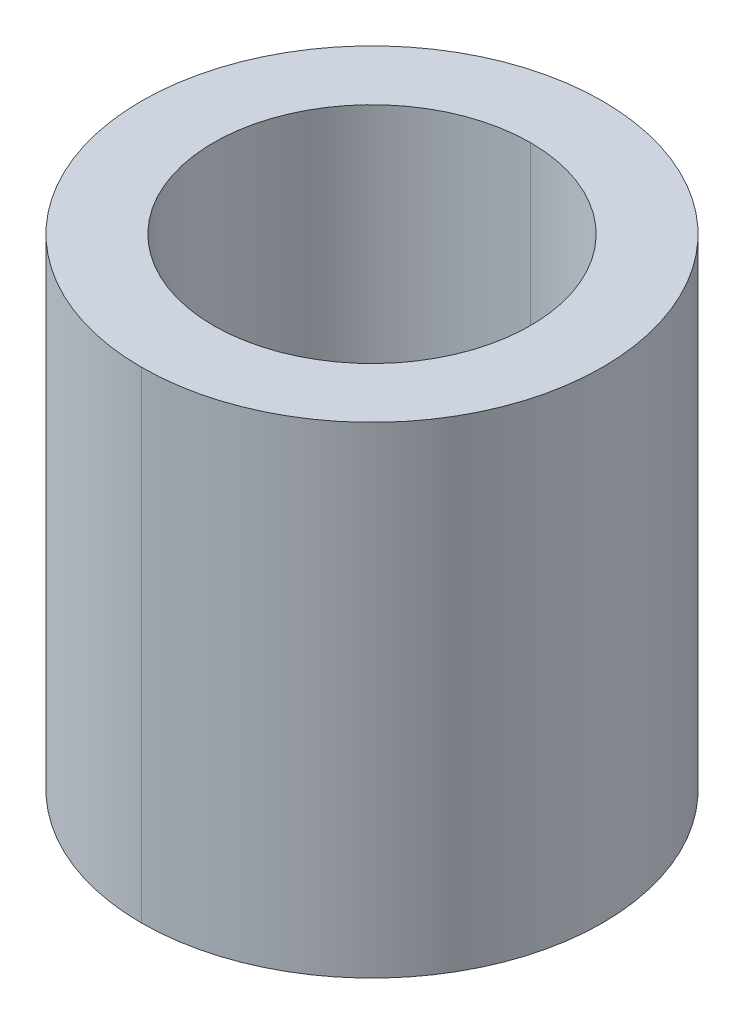
ISO-10303-21;
HEADER;
FILE_DESCRIPTION(('STEP AP214'),'2;1');
FILE_NAME('part.step','',(''),(''),'','','');
FILE_SCHEMA(('AUTOMOTIVE_DESIGN { 1 0 10303 214 1 1 1 1 }'));
ENDSEC;
DATA;
#1=APPLICATION_CONTEXT('core data for automotive mechanical design processes');
#2=APPLICATION_PROTOCOL_DEFINITION('international standard','automotive_design',2000,#1);
#3=PRODUCT_CONTEXT('',#1,'mechanical');
#4=PRODUCT('Part','Part','',(#3));
#5=PRODUCT_RELATED_PRODUCT_CATEGORY('part','',(#4));
#6=PRODUCT_DEFINITION_FORMATION('','',#4);
#7=PRODUCT_DEFINITION_CONTEXT('part definition',#1,'design');
#8=PRODUCT_DEFINITION('design','',#6,#7);
#9=PRODUCT_DEFINITION_SHAPE('','',#8);
#10=(LENGTH_UNIT() NAMED_UNIT(*) SI_UNIT(.MILLI.,.METRE.));
#11=(NAMED_UNIT(*) PLANE_ANGLE_UNIT() SI_UNIT($,.RADIAN.));
#12=(NAMED_UNIT(*) SI_UNIT($,.STERADIAN.) SOLID_ANGLE_UNIT());
#13=UNCERTAINTY_MEASURE_WITH_UNIT(LENGTH_MEASURE(1.E-05),#10,'distance_accuracy_value','');
#14=(GEOMETRIC_REPRESENTATION_CONTEXT(3) GLOBAL_UNCERTAINTY_ASSIGNED_CONTEXT((#13)) GLOBAL_UNIT_ASSIGNED_CONTEXT((#10,
#11,#12)) REPRESENTATION_CONTEXT('',''));
#15=CARTESIAN_POINT('',(0.,0.,0.));
#16=DIRECTION('',(0.,0.,1.));
#17=DIRECTION('',(1.,0.,0.));
#18=AXIS2_PLACEMENT_3D('',#15,#16,#17);
#19=CARTESIAN_POINT('',(0.,8.35,0.));
#20=DIRECTION('',(0.,-1.,0.));
#21=DIRECTION('',(0.,0.,-1.));
#22=AXIS2_PLACEMENT_3D('',#19,#20,#21);
#23=CYLINDRICAL_SURFACE('',#22,2.75);
#24=DIRECTION('',(0.,-1.,0.));
#25=VECTOR('',#24,1.);
#26=CARTESIAN_POINT('',(0.,8.35,2.75));
#27=LINE('',#26,#25);
#28=CARTESIAN_POINT('',(0.,8.35,2.75));
#29=VERTEX_POINT('',#28);
#30=CARTESIAN_POINT('',(0.,0.,2.75));
#31=VERTEX_POINT('',#30);
#32=EDGE_CURVE('E76',#29,#31,#27,.T.);
#33=ORIENTED_EDGE('',*,*,#32,.F.);
#34=CARTESIAN_POINT('',(0.,8.35,0.));
#35=DIRECTION('',(0.,1.,0.));
#36=DIRECTION('',(0.,0.,1.));
#37=AXIS2_PLACEMENT_3D('',#34,#35,#36);
#38=CIRCLE('',#37,2.75);
#39=CARTESIAN_POINT('',(0.,8.35,-2.75));
#40=VERTEX_POINT('',#39);
#41=EDGE_CURVE('E71',#29,#40,#38,.T.);
#42=ORIENTED_EDGE('',*,*,#41,.T.);
#43=DIRECTION('',(0.,-1.,0.));
#44=VECTOR('',#43,1.);
#45=CARTESIAN_POINT('',(0.,8.35,-2.75));
#46=LINE('',#45,#44);
#47=CARTESIAN_POINT('',(0.,0.,-2.75));
#48=VERTEX_POINT('',#47);
#49=EDGE_CURVE('E73',#40,#48,#46,.T.);
#50=ORIENTED_EDGE('',*,*,#49,.T.);
#51=CARTESIAN_POINT('',(0.,0.,0.));
#52=DIRECTION('',(0.,1.,0.));
#53=DIRECTION('',(0.,0.,1.));
#54=AXIS2_PLACEMENT_3D('',#51,#52,#53);
#55=CIRCLE('',#54,2.75);
#56=EDGE_CURVE('E11',#31,#48,#55,.T.);
#57=ORIENTED_EDGE('',*,*,#56,.F.);
#58=EDGE_LOOP('',(#33,#42,#50,#57));
#59=FACE_BOUND('',#58,.T.);
#60=ADVANCED_FACE('F17',(#59),#23,.F.);
#61=CARTESIAN_POINT('',(0.,8.35,0.));
#62=DIRECTION('',(0.,-1.,0.));
#63=DIRECTION('',(0.,0.,-1.));
#64=AXIS2_PLACEMENT_3D('',#61,#62,#63);
#65=CYLINDRICAL_SURFACE('',#64,4.);
#66=DIRECTION('',(0.,-1.,0.));
#67=VECTOR('',#66,1.);
#68=CARTESIAN_POINT('',(0.,8.35,4.));
#69=LINE('',#68,#67);
#70=CARTESIAN_POINT('',(0.,8.35,4.));
#71=VERTEX_POINT('',#70);
#72=CARTESIAN_POINT('',(0.,0.,4.));
#73=VERTEX_POINT('',#72);
#74=EDGE_CURVE('E110',#71,#73,#69,.T.);
#75=ORIENTED_EDGE('',*,*,#74,.F.);
#76=CARTESIAN_POINT('',(0.,8.35,0.));
#77=DIRECTION('',(0.,1.,0.));
#78=DIRECTION('',(0.,0.,1.));
#79=AXIS2_PLACEMENT_3D('',#76,#77,#78);
#80=CIRCLE('',#79,4.);
#81=CARTESIAN_POINT('',(0.,8.35,-4.));
#82=VERTEX_POINT('',#81);
#83=EDGE_CURVE('E81',#82,#71,#80,.T.);
#84=ORIENTED_EDGE('',*,*,#83,.F.);
#85=DIRECTION('',(0.,-1.,0.));
#86=VECTOR('',#85,1.);
#87=CARTESIAN_POINT('',(0.,8.35,-4.));
#88=LINE('',#87,#86);
#89=CARTESIAN_POINT('',(0.,0.,-4.));
#90=VERTEX_POINT('',#89);
#91=EDGE_CURVE('E114',#82,#90,#88,.T.);
#92=ORIENTED_EDGE('',*,*,#91,.T.);
#93=CARTESIAN_POINT('',(0.,0.,0.));
#94=DIRECTION('',(0.,1.,0.));
#95=DIRECTION('',(0.,0.,1.));
#96=AXIS2_PLACEMENT_3D('',#93,#94,#95);
#97=CIRCLE('',#96,4.);
#98=EDGE_CURVE('E25',#90,#73,#97,.T.);
#99=ORIENTED_EDGE('',*,*,#98,.T.);
#100=EDGE_LOOP('',(#75,#84,#92,#99));
#101=FACE_BOUND('',#100,.T.);
#102=ADVANCED_FACE('F121',(#101),#65,.T.);
#103=CARTESIAN_POINT('',(0.,0.,0.));
#104=DIRECTION('',(0.,1.,0.));
#105=DIRECTION('',(1.,0.,0.));
#106=AXIS2_PLACEMENT_3D('',#103,#104,#105);
#107=PLANE('',#106);
#108=CARTESIAN_POINT('',(0.,0.,0.));
#109=DIRECTION('',(0.,1.,0.));
#110=DIRECTION('',(0.,0.,1.));
#111=AXIS2_PLACEMENT_3D('',#108,#109,#110);
#112=CIRCLE('',#111,2.75);
#113=EDGE_CURVE('E87',#48,#31,#112,.T.);
#114=ORIENTED_EDGE('',*,*,#113,.T.);
#115=ORIENTED_EDGE('',*,*,#56,.T.);
#116=EDGE_LOOP('',(#114,#115));
#117=FACE_BOUND('',#116,.T.);
#118=ORIENTED_EDGE('',*,*,#98,.F.);
#119=CARTESIAN_POINT('',(0.,0.,0.));
#120=DIRECTION('',(0.,1.,0.));
#121=DIRECTION('',(0.,0.,1.));
#122=AXIS2_PLACEMENT_3D('',#119,#120,#121);
#123=CIRCLE('',#122,4.);
#124=EDGE_CURVE('E101',#73,#90,#123,.T.);
#125=ORIENTED_EDGE('',*,*,#124,.F.);
#126=EDGE_LOOP('',(#118,#125));
#127=FACE_BOUND('',#126,.T.);
#128=ADVANCED_FACE('F202',(#117,#127),#107,.F.);
#129=CARTESIAN_POINT('',(0.,8.35,0.));
#130=DIRECTION('',(0.,1.,0.));
#131=DIRECTION('',(1.,0.,0.));
#132=AXIS2_PLACEMENT_3D('',#129,#130,#131);
#133=PLANE('',#132);
#134=CARTESIAN_POINT('',(0.,8.35,0.));
#135=DIRECTION('',(0.,1.,0.));
#136=DIRECTION('',(0.,0.,1.));
#137=AXIS2_PLACEMENT_3D('',#134,#135,#136);
#138=CIRCLE('',#137,2.75);
#139=EDGE_CURVE('E85',#40,#29,#138,.T.);
#140=ORIENTED_EDGE('',*,*,#139,.F.);
#141=ORIENTED_EDGE('',*,*,#41,.F.);
#142=EDGE_LOOP('',(#140,#141));
#143=FACE_BOUND('',#142,.T.);
#144=ORIENTED_EDGE('',*,*,#83,.T.);
#145=CARTESIAN_POINT('',(0.,8.35,0.));
#146=DIRECTION('',(0.,1.,0.));
#147=DIRECTION('',(0.,0.,1.));
#148=AXIS2_PLACEMENT_3D('',#145,#146,#147);
#149=CIRCLE('',#148,4.);
#150=EDGE_CURVE('E89',#71,#82,#149,.T.);
#151=ORIENTED_EDGE('',*,*,#150,.T.);
#152=EDGE_LOOP('',(#144,#151));
#153=FACE_BOUND('',#152,.T.);
#154=ADVANCED_FACE('F91',(#143,#153),#133,.T.);
#155=CARTESIAN_POINT('',(0.,8.35,0.));
#156=DIRECTION('',(0.,-1.,0.));
#157=DIRECTION('',(0.,0.,-1.));
#158=AXIS2_PLACEMENT_3D('',#155,#156,#157);
#159=CYLINDRICAL_SURFACE('',#158,4.);
#160=ORIENTED_EDGE('',*,*,#150,.F.);
#161=ORIENTED_EDGE('',*,*,#74,.T.);
#162=ORIENTED_EDGE('',*,*,#124,.T.);
#163=ORIENTED_EDGE('',*,*,#91,.F.);
#164=EDGE_LOOP('',(#160,#161,#162,#163));
#165=FACE_BOUND('',#164,.T.);
#166=ADVANCED_FACE('F124',(#165),#159,.T.);
#167=CARTESIAN_POINT('',(0.,8.35,0.));
#168=DIRECTION('',(0.,-1.,0.));
#169=DIRECTION('',(0.,0.,-1.));
#170=AXIS2_PLACEMENT_3D('',#167,#168,#169);
#171=CYLINDRICAL_SURFACE('',#170,2.75);
#172=ORIENTED_EDGE('',*,*,#139,.T.);
#173=ORIENTED_EDGE('',*,*,#32,.T.);
#174=ORIENTED_EDGE('',*,*,#113,.F.);
#175=ORIENTED_EDGE('',*,*,#49,.F.);
#176=EDGE_LOOP('',(#172,#173,#174,#175));
#177=FACE_BOUND('',#176,.T.);
#178=ADVANCED_FACE('F84',(#177),#171,.F.);
#179=CLOSED_SHELL('',(#60,#102,#128,#154,#166,#178));
#180=MANIFOLD_SOLID_BREP('B1',#179);
#181=ADVANCED_BREP_SHAPE_REPRESENTATION('',(#18,#180),#14);
#182=SHAPE_DEFINITION_REPRESENTATION(#9,#181);
ENDSEC;
END-ISO-10303-21;
